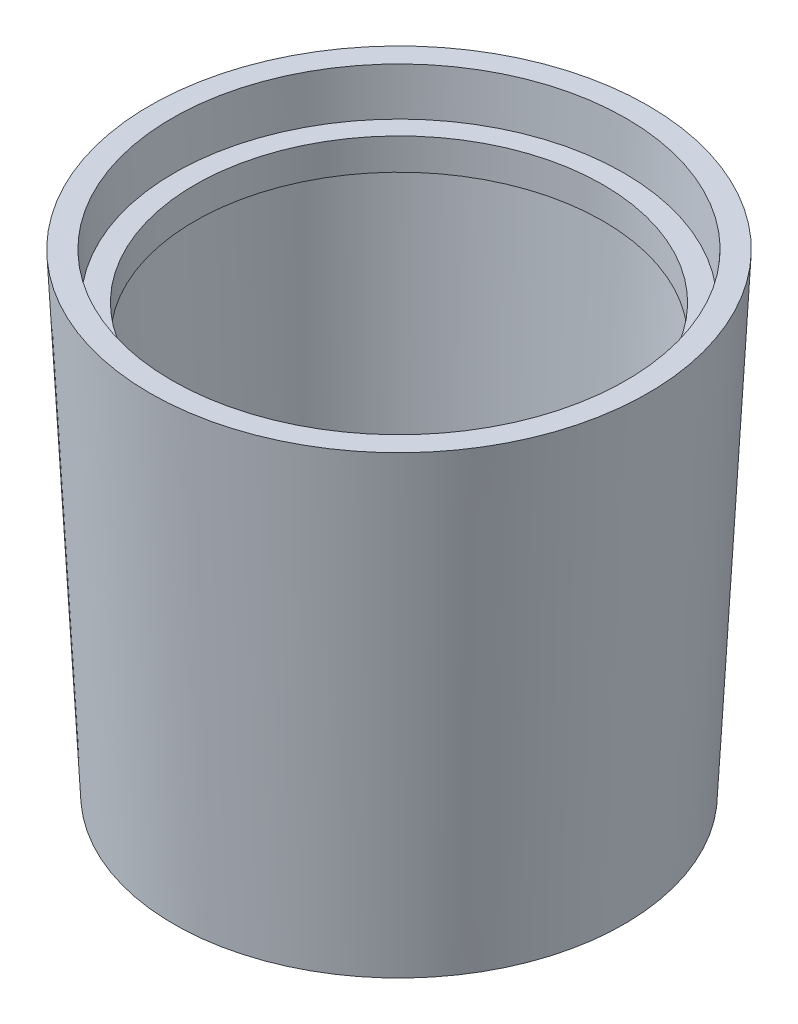
ISO-10303-21;
HEADER;
FILE_DESCRIPTION(('STEP AP214'),'2;1');
FILE_NAME('part.step','',(''),(''),'','','');
FILE_SCHEMA(('AUTOMOTIVE_DESIGN { 1 0 10303 214 1 1 1 1 }'));
ENDSEC;
DATA;
#1=APPLICATION_CONTEXT('core data for automotive mechanical design processes');
#2=APPLICATION_PROTOCOL_DEFINITION('international standard','automotive_design',2000,#1);
#3=PRODUCT_CONTEXT('',#1,'mechanical');
#4=PRODUCT('Part','Part','',(#3));
#5=PRODUCT_RELATED_PRODUCT_CATEGORY('part','',(#4));
#6=PRODUCT_DEFINITION_FORMATION('','',#4);
#7=PRODUCT_DEFINITION_CONTEXT('part definition',#1,'design');
#8=PRODUCT_DEFINITION('design','',#6,#7);
#9=PRODUCT_DEFINITION_SHAPE('','',#8);
#10=(LENGTH_UNIT() NAMED_UNIT(*) SI_UNIT(.MILLI.,.METRE.));
#11=(NAMED_UNIT(*) PLANE_ANGLE_UNIT() SI_UNIT($,.RADIAN.));
#12=(NAMED_UNIT(*) SI_UNIT($,.STERADIAN.) SOLID_ANGLE_UNIT());
#13=UNCERTAINTY_MEASURE_WITH_UNIT(LENGTH_MEASURE(1.E-05),#10,'distance_accuracy_value','');
#14=(GEOMETRIC_REPRESENTATION_CONTEXT(3) GLOBAL_UNCERTAINTY_ASSIGNED_CONTEXT((#13)) GLOBAL_UNIT_ASSIGNED_CONTEXT((#10,
#11,#12)) REPRESENTATION_CONTEXT('',''));
#15=CARTESIAN_POINT('',(0.,0.,0.));
#16=DIRECTION('',(0.,0.,1.));
#17=DIRECTION('',(1.,0.,0.));
#18=AXIS2_PLACEMENT_3D('',#15,#16,#17);
#19=CARTESIAN_POINT('',(-752.,0.,0.));
#20=DIRECTION('',(0.,-1.,0.));
#21=DIRECTION('',(0.,0.,-1.));
#22=AXIS2_PLACEMENT_3D('',#19,#20,#21);
#23=CYLINDRICAL_SURFACE('',#22,368.551894005198);
#24=CARTESIAN_POINT('',(-752.,0.,0.));
#25=DIRECTION('',(0.,-1.,0.));
#26=DIRECTION('',(0.,0.,-1.));
#27=AXIS2_PLACEMENT_3D('',#24,#25,#26);
#28=CIRCLE('',#27,368.551894005198);
#29=CARTESIAN_POINT('',(-752.,0.,-368.551894005198));
#30=VERTEX_POINT('',#29);
#31=EDGE_CURVE('E67',#30,#30,#28,.T.);
#32=ORIENTED_EDGE('',*,*,#31,.T.);
#33=EDGE_LOOP('',(#32));
#34=FACE_BOUND('',#33,.T.);
#35=CARTESIAN_POINT('',(-752.,48.4971976416091,0.));
#36=DIRECTION('',(0.,-1.,0.));
#37=DIRECTION('',(0.,0.,-1.));
#38=AXIS2_PLACEMENT_3D('',#35,#36,#37);
#39=CIRCLE('',#38,368.551894005198);
#40=CARTESIAN_POINT('',(-752.,48.4971976416091,-368.551894005198));
#41=VERTEX_POINT('',#40);
#42=EDGE_CURVE('E10',#41,#41,#39,.T.);
#43=ORIENTED_EDGE('',*,*,#42,.F.);
#44=EDGE_LOOP('',(#43));
#45=FACE_BOUND('',#44,.T.);
#46=ADVANCED_FACE('F33',(#34,#45),#23,.F.);
#47=CARTESIAN_POINT('',(-383.448105994802,48.4971976416091,0.));
#48=DIRECTION('',(0.,1.,0.));
#49=DIRECTION('',(0.,0.,1.));
#50=AXIS2_PLACEMENT_3D('',#47,#48,#49);
#51=PLANE('',#50);
#52=ORIENTED_EDGE('',*,*,#42,.T.);
#53=EDGE_LOOP('',(#52));
#54=FACE_BOUND('',#53,.T.);
#55=CARTESIAN_POINT('',(-752.,48.4971976416091,0.));
#56=DIRECTION('',(0.,-1.,0.));
#57=DIRECTION('',(0.,0.,-1.));
#58=AXIS2_PLACEMENT_3D('',#55,#56,#57);
#59=CIRCLE('',#58,413.8694906414);
#60=CARTESIAN_POINT('',(-752.,48.4971976416091,-413.8694906414));
#61=VERTEX_POINT('',#60);
#62=EDGE_CURVE('E39',#61,#61,#59,.T.);
#63=ORIENTED_EDGE('',*,*,#62,.F.);
#64=EDGE_LOOP('',(#63));
#65=FACE_BOUND('',#64,.T.);
#66=ADVANCED_FACE('F85',(#54,#65),#51,.T.);
#67=CARTESIAN_POINT('',(-752.,800.688106683197,0.));
#68=DIRECTION('',(0.,1.,0.));
#69=DIRECTION('',(0.,0.,1.));
#70=AXIS2_PLACEMENT_3D('',#67,#68,#69);
#71=CONICAL_SURFACE('',#70,452.106708287246,0.0507907385720836);
#72=ORIENTED_EDGE('',*,*,#62,.T.);
#73=EDGE_LOOP('',(#72));
#74=FACE_BOUND('',#73,.T.);
#75=CARTESIAN_POINT('',(-752.,800.688106683197,0.));
#76=DIRECTION('',(0.,-1.,0.));
#77=DIRECTION('',(0.,0.,-1.));
#78=AXIS2_PLACEMENT_3D('',#75,#76,#77);
#79=CIRCLE('',#78,452.106708287246);
#80=CARTESIAN_POINT('',(-752.,800.688106683197,-452.106708287246));
#81=VERTEX_POINT('',#80);
#82=EDGE_CURVE('E43',#81,#81,#79,.T.);
#83=ORIENTED_EDGE('',*,*,#82,.F.);
#84=EDGE_LOOP('',(#83));
#85=FACE_BOUND('',#84,.T.);
#86=ADVANCED_FACE('F89',(#74,#85),#71,.F.);
#87=CARTESIAN_POINT('',(-337.722580964936,800.688106683197,0.));
#88=DIRECTION('',(0.,-1.,0.));
#89=DIRECTION('',(0.,0.,-1.));
#90=AXIS2_PLACEMENT_3D('',#87,#88,#89);
#91=PLANE('',#90);
#92=ORIENTED_EDGE('',*,*,#82,.T.);
#93=EDGE_LOOP('',(#92));
#94=FACE_BOUND('',#93,.T.);
#95=CARTESIAN_POINT('',(-752.,800.688106683197,0.));
#96=DIRECTION('',(0.,-1.,0.));
#97=DIRECTION('',(0.,0.,-1.));
#98=AXIS2_PLACEMENT_3D('',#95,#96,#97);
#99=CIRCLE('',#98,414.277419035064);
#100=CARTESIAN_POINT('',(-752.,800.688106683197,-414.277419035064));
#101=VERTEX_POINT('',#100);
#102=EDGE_CURVE('E47',#101,#101,#99,.T.);
#103=ORIENTED_EDGE('',*,*,#102,.F.);
#104=EDGE_LOOP('',(#103));
#105=FACE_BOUND('',#104,.T.);
#106=ADVANCED_FACE('F93',(#94,#105),#91,.T.);
#107=CARTESIAN_POINT('',(-752.,0.,0.));
#108=DIRECTION('',(0.,-1.,0.));
#109=DIRECTION('',(0.,0.,-1.));
#110=AXIS2_PLACEMENT_3D('',#107,#108,#109);
#111=CYLINDRICAL_SURFACE('',#110,414.277419035064);
#112=ORIENTED_EDGE('',*,*,#102,.T.);
#113=EDGE_LOOP('',(#112));
#114=FACE_BOUND('',#113,.T.);
#115=CARTESIAN_POINT('',(-752.,864.413184913381,0.));
#116=DIRECTION('',(0.,-1.,0.));
#117=DIRECTION('',(0.,0.,-1.));
#118=AXIS2_PLACEMENT_3D('',#115,#116,#117);
#119=CIRCLE('',#118,414.277419035064);
#120=CARTESIAN_POINT('',(-752.,864.413184913381,-414.277419035064));
#121=VERTEX_POINT('',#120);
#122=EDGE_CURVE('E52',#121,#121,#119,.T.);
#123=ORIENTED_EDGE('',*,*,#122,.F.);
#124=EDGE_LOOP('',(#123));
#125=FACE_BOUND('',#124,.T.);
#126=ADVANCED_FACE('F99',(#114,#125),#111,.F.);
#127=CARTESIAN_POINT('',(-295.815730173116,864.413184913381,0.));
#128=DIRECTION('',(0.,1.,0.));
#129=DIRECTION('',(0.,0.,1.));
#130=AXIS2_PLACEMENT_3D('',#127,#128,#129);
#131=PLANE('',#130);
#132=ORIENTED_EDGE('',*,*,#122,.T.);
#133=EDGE_LOOP('',(#132));
#134=FACE_BOUND('',#133,.T.);
#135=CARTESIAN_POINT('',(-752.,864.413184913381,0.));
#136=DIRECTION('',(0.,-1.,0.));
#137=DIRECTION('',(0.,0.,-1.));
#138=AXIS2_PLACEMENT_3D('',#135,#136,#137);
#139=CIRCLE('',#138,456.184269826884);
#140=CARTESIAN_POINT('',(-752.,864.413184913381,-456.184269826884));
#141=VERTEX_POINT('',#140);
#142=EDGE_CURVE('E55',#141,#141,#139,.T.);
#143=ORIENTED_EDGE('',*,*,#142,.F.);
#144=EDGE_LOOP('',(#143));
#145=FACE_BOUND('',#144,.T.);
#146=ADVANCED_FACE('F103',(#134,#145),#131,.T.);
#147=CARTESIAN_POINT('',(-752.,957.956271748174,0.));
#148=DIRECTION('',(0.,1.,0.));
#149=DIRECTION('',(0.,0.,1.));
#150=AXIS2_PLACEMENT_3D('',#147,#148,#149);
#151=CONICAL_SURFACE('',#150,460.939482004499,0.0507907385720839);
#152=ORIENTED_EDGE('',*,*,#142,.T.);
#153=EDGE_LOOP('',(#152));
#154=FACE_BOUND('',#153,.T.);
#155=CARTESIAN_POINT('',(-752.,957.956271748174,0.));
#156=DIRECTION('',(0.,-1.,0.));
#157=DIRECTION('',(0.,0.,-1.));
#158=AXIS2_PLACEMENT_3D('',#155,#156,#157);
#159=CIRCLE('',#158,460.939482004499);
#160=CARTESIAN_POINT('',(-752.,957.956271748174,-460.939482004499));
#161=VERTEX_POINT('',#160);
#162=EDGE_CURVE('E58',#161,#161,#159,.T.);
#163=ORIENTED_EDGE('',*,*,#162,.F.);
#164=EDGE_LOOP('',(#163));
#165=FACE_BOUND('',#164,.T.);
#166=ADVANCED_FACE('F107',(#154,#165),#151,.F.);
#167=CARTESIAN_POINT('',(-246.33480167821,957.956271748174,0.));
#168=DIRECTION('',(0.,1.,0.));
#169=DIRECTION('',(0.,0.,1.));
#170=AXIS2_PLACEMENT_3D('',#167,#168,#169);
#171=PLANE('',#170);
#172=ORIENTED_EDGE('',*,*,#162,.T.);
#173=EDGE_LOOP('',(#172));
#174=FACE_BOUND('',#173,.T.);
#175=CARTESIAN_POINT('',(-752.,957.956271748174,0.));
#176=DIRECTION('',(0.,-1.,0.));
#177=DIRECTION('',(0.,0.,-1.));
#178=AXIS2_PLACEMENT_3D('',#175,#176,#177);
#179=CIRCLE('',#178,505.66519832179);
#180=CARTESIAN_POINT('',(-752.,957.956271748174,-505.66519832179));
#181=VERTEX_POINT('',#180);
#182=EDGE_CURVE('E61',#181,#181,#179,.T.);
#183=ORIENTED_EDGE('',*,*,#182,.F.);
#184=EDGE_LOOP('',(#183));
#185=FACE_BOUND('',#184,.T.);
#186=ADVANCED_FACE('F81',(#174,#185),#171,.T.);
#187=CARTESIAN_POINT('',(-752.,0.,0.));
#188=DIRECTION('',(0.,1.,0.));
#189=DIRECTION('',(0.,0.,1.));
#190=AXIS2_PLACEMENT_3D('',#187,#188,#189);
#191=CONICAL_SURFACE('',#190,456.968009858411,0.0507907385720838);
#192=ORIENTED_EDGE('',*,*,#182,.T.);
#193=EDGE_LOOP('',(#192));
#194=FACE_BOUND('',#193,.T.);
#195=CARTESIAN_POINT('',(-752.,0.,0.));
#196=DIRECTION('',(0.,-1.,0.));
#197=DIRECTION('',(0.,0.,-1.));
#198=AXIS2_PLACEMENT_3D('',#195,#196,#197);
#199=CIRCLE('',#198,456.968009858411);
#200=CARTESIAN_POINT('',(-752.,0.,-456.968009858411));
#201=VERTEX_POINT('',#200);
#202=EDGE_CURVE('E64',#201,#201,#199,.T.);
#203=ORIENTED_EDGE('',*,*,#202,.F.);
#204=EDGE_LOOP('',(#203));
#205=FACE_BOUND('',#204,.T.);
#206=ADVANCED_FACE('F75',(#194,#205),#191,.T.);
#207=CARTESIAN_POINT('',(-383.448105994802,0.,0.));
#208=DIRECTION('',(0.,-1.,0.));
#209=DIRECTION('',(0.,0.,-1.));
#210=AXIS2_PLACEMENT_3D('',#207,#208,#209);
#211=PLANE('',#210);
#212=ORIENTED_EDGE('',*,*,#202,.T.);
#213=EDGE_LOOP('',(#212));
#214=FACE_BOUND('',#213,.T.);
#215=ORIENTED_EDGE('',*,*,#31,.F.);
#216=EDGE_LOOP('',(#215));
#217=FACE_BOUND('',#216,.T.);
#218=ADVANCED_FACE('F73',(#214,#217),#211,.T.);
#219=CLOSED_SHELL('',(#46,#66,#86,#106,#126,#146,#166,#186,#206,#218));
#220=MANIFOLD_SOLID_BREP('B2',#219);
#221=ADVANCED_BREP_SHAPE_REPRESENTATION('',(#18,#220),#14);
#222=SHAPE_DEFINITION_REPRESENTATION(#9,#221);
ENDSEC;
END-ISO-10303-21;
